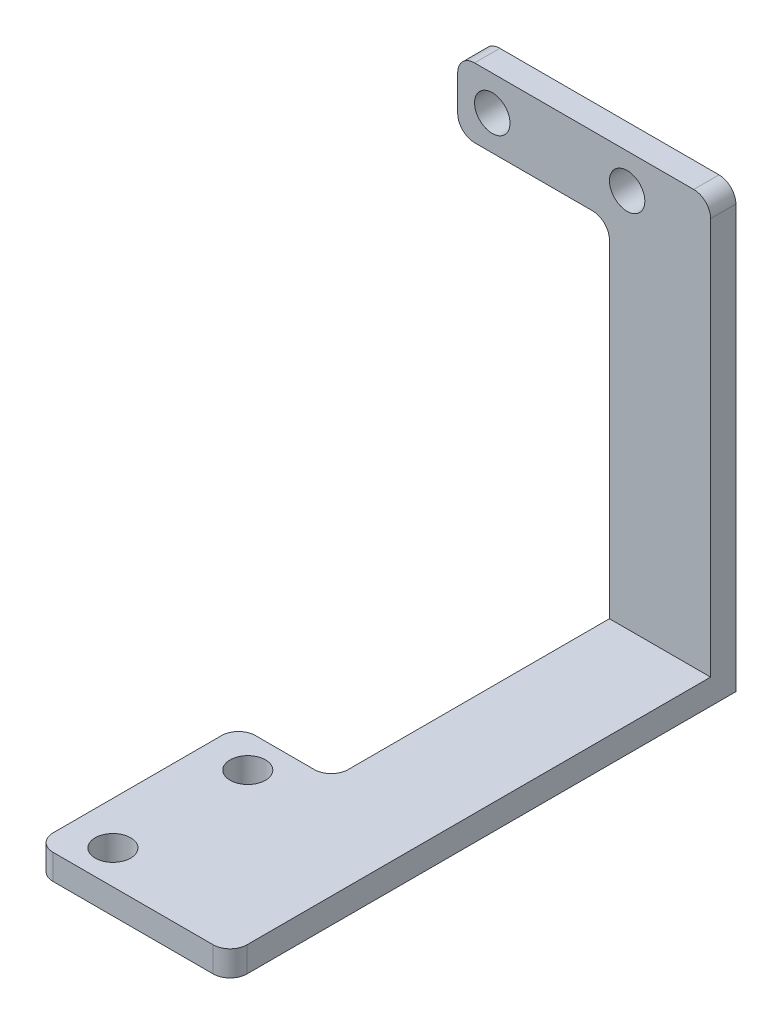
ISO-10303-21;
HEADER;
FILE_DESCRIPTION(('STEP AP214'),'2;1');
FILE_NAME('part.step','',(''),(''),'','','');
FILE_SCHEMA(('AUTOMOTIVE_DESIGN { 1 0 10303 214 1 1 1 1 }'));
ENDSEC;
DATA;
#1=APPLICATION_CONTEXT('core data for automotive mechanical design processes');
#2=APPLICATION_PROTOCOL_DEFINITION('international standard','automotive_design',2000,#1);
#3=PRODUCT_CONTEXT('',#1,'mechanical');
#4=PRODUCT('Part','Part','',(#3));
#5=PRODUCT_RELATED_PRODUCT_CATEGORY('part','',(#4));
#6=PRODUCT_DEFINITION_FORMATION('','',#4);
#7=PRODUCT_DEFINITION_CONTEXT('part definition',#1,'design');
#8=PRODUCT_DEFINITION('design','',#6,#7);
#9=PRODUCT_DEFINITION_SHAPE('','',#8);
#10=(LENGTH_UNIT() NAMED_UNIT(*) SI_UNIT(.MILLI.,.METRE.));
#11=(NAMED_UNIT(*) PLANE_ANGLE_UNIT() SI_UNIT($,.RADIAN.));
#12=(NAMED_UNIT(*) SI_UNIT($,.STERADIAN.) SOLID_ANGLE_UNIT());
#13=UNCERTAINTY_MEASURE_WITH_UNIT(LENGTH_MEASURE(1.E-05),#10,'distance_accuracy_value','');
#14=(GEOMETRIC_REPRESENTATION_CONTEXT(3) GLOBAL_UNCERTAINTY_ASSIGNED_CONTEXT((#13)) GLOBAL_UNIT_ASSIGNED_CONTEXT((#10,
#11,#12)) REPRESENTATION_CONTEXT('',''));
#15=CARTESIAN_POINT('',(0.,0.,0.));
#16=DIRECTION('',(0.,0.,1.));
#17=DIRECTION('',(1.,0.,0.));
#18=AXIS2_PLACEMENT_3D('',#15,#16,#17);
#19=CARTESIAN_POINT('',(0.,3.,0.));
#20=DIRECTION('',(0.,-1.,0.));
#21=DIRECTION('',(0.,0.,-1.));
#22=AXIS2_PLACEMENT_3D('',#19,#20,#21);
#23=PLANE('',#22);
#24=DIRECTION('',(1.,0.,0.));
#25=VECTOR('',#24,1.);
#26=CARTESIAN_POINT('',(6.00000000000001,3.,57.));
#27=LINE('',#26,#25);
#28=CARTESIAN_POINT('',(-15.,3.,57.));
#29=VERTEX_POINT('',#28);
#30=CARTESIAN_POINT('',(4.00000000000001,3.,57.));
#31=VERTEX_POINT('',#30);
#32=EDGE_CURVE('E224',#29,#31,#27,.T.);
#33=ORIENTED_EDGE('',*,*,#32,.T.);
#34=CARTESIAN_POINT('',(4.00000000000001,3.,55.));
#35=DIRECTION('',(0.,-1.,0.));
#36=DIRECTION('',(0.,0.,-1.));
#37=AXIS2_PLACEMENT_3D('',#34,#35,#36);
#38=CIRCLE('',#37,2.);
#39=CARTESIAN_POINT('',(6.00000000000001,3.,55.));
#40=VERTEX_POINT('',#39);
#41=EDGE_CURVE('E295',#31,#40,#38,.F.);
#42=ORIENTED_EDGE('',*,*,#41,.T.);
#43=DIRECTION('',(0.,0.,-1.));
#44=VECTOR('',#43,1.);
#45=CARTESIAN_POINT('',(6.,3.,0.));
#46=LINE('',#45,#44);
#47=CARTESIAN_POINT('',(6.,3.,0.));
#48=VERTEX_POINT('',#47);
#49=EDGE_CURVE('E227',#40,#48,#46,.T.);
#50=ORIENTED_EDGE('',*,*,#49,.T.);
#51=DIRECTION('',(-1.,0.,0.));
#52=VECTOR('',#51,1.);
#53=CARTESIAN_POINT('',(-6.,3.,0.));
#54=LINE('',#53,#52);
#55=CARTESIAN_POINT('',(-6.,3.,0.));
#56=VERTEX_POINT('',#55);
#57=EDGE_CURVE('E229',#48,#56,#54,.T.);
#58=ORIENTED_EDGE('',*,*,#57,.T.);
#59=DIRECTION('',(0.,0.,1.));
#60=VECTOR('',#59,1.);
#61=CARTESIAN_POINT('',(-6.,3.,0.));
#62=LINE('',#61,#60);
#63=CARTESIAN_POINT('',(-6.,3.,31.));
#64=VERTEX_POINT('',#63);
#65=EDGE_CURVE('E216',#56,#64,#62,.T.);
#66=ORIENTED_EDGE('',*,*,#65,.T.);
#67=CARTESIAN_POINT('',(-8.,3.,31.));
#68=DIRECTION('',(0.,-1.,0.));
#69=DIRECTION('',(0.,0.,-1.));
#70=AXIS2_PLACEMENT_3D('',#67,#68,#69);
#71=CIRCLE('',#70,2.);
#72=CARTESIAN_POINT('',(-8.,3.,33.));
#73=VERTEX_POINT('',#72);
#74=EDGE_CURVE('E302',#64,#73,#71,.T.);
#75=ORIENTED_EDGE('',*,*,#74,.T.);
#76=DIRECTION('',(-1.,0.,0.));
#77=VECTOR('',#76,1.);
#78=CARTESIAN_POINT('',(-6.,3.,33.));
#79=LINE('',#78,#77);
#80=CARTESIAN_POINT('',(-15.,3.,33.));
#81=VERTEX_POINT('',#80);
#82=EDGE_CURVE('E219',#73,#81,#79,.T.);
#83=ORIENTED_EDGE('',*,*,#82,.T.);
#84=CARTESIAN_POINT('',(-15.,3.,35.));
#85=DIRECTION('',(0.,-1.,0.));
#86=DIRECTION('',(0.,0.,-1.));
#87=AXIS2_PLACEMENT_3D('',#84,#85,#86);
#88=CIRCLE('',#87,2.);
#89=CARTESIAN_POINT('',(-17.,3.,35.));
#90=VERTEX_POINT('',#89);
#91=EDGE_CURVE('E54',#81,#90,#88,.F.);
#92=ORIENTED_EDGE('',*,*,#91,.T.);
#93=DIRECTION('',(0.,0.,1.));
#94=VECTOR('',#93,1.);
#95=CARTESIAN_POINT('',(-17.,3.,57.));
#96=LINE('',#95,#94);
#97=CARTESIAN_POINT('',(-17.,3.,55.));
#98=VERTEX_POINT('',#97);
#99=EDGE_CURVE('E222',#90,#98,#96,.T.);
#100=ORIENTED_EDGE('',*,*,#99,.T.);
#101=CARTESIAN_POINT('',(-15.,3.,55.));
#102=DIRECTION('',(0.,-1.,0.));
#103=DIRECTION('',(0.,0.,-1.));
#104=AXIS2_PLACEMENT_3D('',#101,#102,#103);
#105=CIRCLE('',#104,2.);
#106=EDGE_CURVE('E292',#98,#29,#105,.F.);
#107=ORIENTED_EDGE('',*,*,#106,.T.);
#108=EDGE_LOOP('',(#33,#42,#50,#58,#66,#75,#83,#92,#100,#107));
#109=FACE_BOUND('',#108,.T.);
#110=CARTESIAN_POINT('',(-11.9,3.,37.));
#111=DIRECTION('',(0.,1.,0.));
#112=DIRECTION('',(0.,0.,1.));
#113=AXIS2_PLACEMENT_3D('',#110,#111,#112);
#114=CIRCLE('',#113,2.09999999999999);
#115=CARTESIAN_POINT('',(-11.9,3.,39.1));
#116=VERTEX_POINT('',#115);
#117=EDGE_CURVE('E180',#116,#116,#114,.T.);
#118=ORIENTED_EDGE('',*,*,#117,.F.);
#119=EDGE_LOOP('',(#118));
#120=FACE_BOUND('',#119,.T.);
#121=CARTESIAN_POINT('',(-11.9,3.,53.));
#122=DIRECTION('',(0.,1.,0.));
#123=DIRECTION('',(0.,0.,1.));
#124=AXIS2_PLACEMENT_3D('',#121,#122,#123);
#125=CIRCLE('',#124,2.1);
#126=CARTESIAN_POINT('',(-11.9,3.,55.1));
#127=VERTEX_POINT('',#126);
#128=EDGE_CURVE('E190',#127,#127,#125,.T.);
#129=ORIENTED_EDGE('',*,*,#128,.F.);
#130=EDGE_LOOP('',(#129));
#131=FACE_BOUND('',#130,.T.);
#132=ADVANCED_FACE('F32',(#109,#120,#131),#23,.F.);
#133=CARTESIAN_POINT('',(0.,0.,0.));
#134=DIRECTION('',(0.,-1.,0.));
#135=DIRECTION('',(0.,0.,-1.));
#136=AXIS2_PLACEMENT_3D('',#133,#134,#135);
#137=PLANE('',#136);
#138=CARTESIAN_POINT('',(-11.9,0.,37.));
#139=DIRECTION('',(0.,1.,0.));
#140=DIRECTION('',(0.,0.,1.));
#141=AXIS2_PLACEMENT_3D('',#138,#139,#140);
#142=CIRCLE('',#141,2.09999999999999);
#143=CARTESIAN_POINT('',(-11.9,0.,39.1));
#144=VERTEX_POINT('',#143);
#145=EDGE_CURVE('E210',#144,#144,#142,.T.);
#146=ORIENTED_EDGE('',*,*,#145,.T.);
#147=EDGE_LOOP('',(#146));
#148=FACE_BOUND('',#147,.T.);
#149=DIRECTION('',(0.,0.,-1.));
#150=VECTOR('',#149,1.);
#151=CARTESIAN_POINT('',(6.,0.,0.));
#152=LINE('',#151,#150);
#153=CARTESIAN_POINT('',(6.00000000000001,0.,55.));
#154=VERTEX_POINT('',#153);
#155=CARTESIAN_POINT('',(6.,0.,-3.));
#156=VERTEX_POINT('',#155);
#157=EDGE_CURVE('E220',#154,#156,#152,.T.);
#158=ORIENTED_EDGE('',*,*,#157,.F.);
#159=CARTESIAN_POINT('',(4.00000000000001,0.,55.));
#160=DIRECTION('',(0.,-1.,0.));
#161=DIRECTION('',(0.,0.,-1.));
#162=AXIS2_PLACEMENT_3D('',#159,#160,#161);
#163=CIRCLE('',#162,2.);
#164=CARTESIAN_POINT('',(4.00000000000001,0.,57.));
#165=VERTEX_POINT('',#164);
#166=EDGE_CURVE('E285',#154,#165,#163,.T.);
#167=ORIENTED_EDGE('',*,*,#166,.T.);
#168=DIRECTION('',(1.,0.,0.));
#169=VECTOR('',#168,1.);
#170=CARTESIAN_POINT('',(6.00000000000001,0.,57.));
#171=LINE('',#170,#169);
#172=CARTESIAN_POINT('',(-15.,0.,57.));
#173=VERTEX_POINT('',#172);
#174=EDGE_CURVE('E237',#173,#165,#171,.T.);
#175=ORIENTED_EDGE('',*,*,#174,.F.);
#176=CARTESIAN_POINT('',(-15.,0.,55.));
#177=DIRECTION('',(0.,-1.,0.));
#178=DIRECTION('',(0.,0.,-1.));
#179=AXIS2_PLACEMENT_3D('',#176,#177,#178);
#180=CIRCLE('',#179,2.);
#181=CARTESIAN_POINT('',(-17.,0.,55.));
#182=VERTEX_POINT('',#181);
#183=EDGE_CURVE('E281',#173,#182,#180,.T.);
#184=ORIENTED_EDGE('',*,*,#183,.T.);
#185=DIRECTION('',(0.,0.,1.));
#186=VECTOR('',#185,1.);
#187=CARTESIAN_POINT('',(-17.,0.,57.));
#188=LINE('',#187,#186);
#189=CARTESIAN_POINT('',(-17.,0.,35.));
#190=VERTEX_POINT('',#189);
#191=EDGE_CURVE('E235',#190,#182,#188,.T.);
#192=ORIENTED_EDGE('',*,*,#191,.F.);
#193=CARTESIAN_POINT('',(-15.,0.,35.));
#194=DIRECTION('',(0.,-1.,0.));
#195=DIRECTION('',(0.,0.,-1.));
#196=AXIS2_PLACEMENT_3D('',#193,#194,#195);
#197=CIRCLE('',#196,2.);
#198=CARTESIAN_POINT('',(-15.,0.,33.));
#199=VERTEX_POINT('',#198);
#200=EDGE_CURVE('E283',#190,#199,#197,.T.);
#201=ORIENTED_EDGE('',*,*,#200,.T.);
#202=DIRECTION('',(-1.,0.,0.));
#203=VECTOR('',#202,1.);
#204=CARTESIAN_POINT('',(-6.,0.,33.));
#205=LINE('',#204,#203);
#206=CARTESIAN_POINT('',(-8.,0.,33.));
#207=VERTEX_POINT('',#206);
#208=EDGE_CURVE('E179',#207,#199,#205,.T.);
#209=ORIENTED_EDGE('',*,*,#208,.F.);
#210=CARTESIAN_POINT('',(-8.,0.,31.));
#211=DIRECTION('',(0.,-1.,0.));
#212=DIRECTION('',(0.,0.,-1.));
#213=AXIS2_PLACEMENT_3D('',#210,#211,#212);
#214=CIRCLE('',#213,2.);
#215=CARTESIAN_POINT('',(-6.,0.,31.));
#216=VERTEX_POINT('',#215);
#217=EDGE_CURVE('E178',#207,#216,#214,.F.);
#218=ORIENTED_EDGE('',*,*,#217,.T.);
#219=DIRECTION('',(0.,0.,1.));
#220=VECTOR('',#219,1.);
#221=CARTESIAN_POINT('',(-6.,0.,0.));
#222=LINE('',#221,#220);
#223=CARTESIAN_POINT('',(-6.,0.,-3.));
#224=VERTEX_POINT('',#223);
#225=EDGE_CURVE('E161',#224,#216,#222,.T.);
#226=ORIENTED_EDGE('',*,*,#225,.F.);
#227=DIRECTION('',(1.,0.,0.));
#228=VECTOR('',#227,1.);
#229=CARTESIAN_POINT('',(6.,0.,-3.));
#230=LINE('',#229,#228);
#231=EDGE_CURVE('E169',#224,#156,#230,.T.);
#232=ORIENTED_EDGE('',*,*,#231,.T.);
#233=EDGE_LOOP('',(#158,#167,#175,#184,#192,#201,#209,#218,#226,#232));
#234=FACE_BOUND('',#233,.T.);
#235=CARTESIAN_POINT('',(-11.9,0.,53.));
#236=DIRECTION('',(0.,1.,0.));
#237=DIRECTION('',(0.,0.,1.));
#238=AXIS2_PLACEMENT_3D('',#235,#236,#237);
#239=CIRCLE('',#238,2.1);
#240=CARTESIAN_POINT('',(-11.9,0.,55.1));
#241=VERTEX_POINT('',#240);
#242=EDGE_CURVE('E187',#241,#241,#239,.T.);
#243=ORIENTED_EDGE('',*,*,#242,.T.);
#244=EDGE_LOOP('',(#243));
#245=FACE_BOUND('',#244,.T.);
#246=ADVANCED_FACE('F175',(#148,#234,#245),#137,.T.);
#247=CARTESIAN_POINT('',(-6.,3.,0.));
#248=DIRECTION('',(1.,0.,0.));
#249=DIRECTION('',(0.,0.,-1.));
#250=AXIS2_PLACEMENT_3D('',#247,#248,#249);
#251=PLANE('',#250);
#252=ORIENTED_EDGE('',*,*,#225,.T.);
#253=DIRECTION('',(0.,-1.,0.));
#254=VECTOR('',#253,1.);
#255=CARTESIAN_POINT('',(-6.,3.,31.));
#256=LINE('',#255,#254);
#257=EDGE_CURVE('E246',#216,#64,#256,.F.);
#258=ORIENTED_EDGE('',*,*,#257,.T.);
#259=ORIENTED_EDGE('',*,*,#65,.F.);
#260=DIRECTION('',(0.,-1.,0.));
#261=VECTOR('',#260,1.);
#262=CARTESIAN_POINT('',(-6.,0.,0.));
#263=LINE('',#262,#261);
#264=CARTESIAN_POINT('',(-6.,41.9,0.));
#265=VERTEX_POINT('',#264);
#266=EDGE_CURVE('E207',#265,#56,#263,.T.);
#267=ORIENTED_EDGE('',*,*,#266,.F.);
#268=DIRECTION('',(0.,0.,1.));
#269=VECTOR('',#268,1.);
#270=CARTESIAN_POINT('',(-6.,41.9,0.));
#271=LINE('',#270,#269);
#272=CARTESIAN_POINT('',(-6.,41.9,-3.));
#273=VERTEX_POINT('',#272);
#274=EDGE_CURVE('E165',#265,#273,#271,.F.);
#275=ORIENTED_EDGE('',*,*,#274,.T.);
#276=DIRECTION('',(0.,-1.,0.));
#277=VECTOR('',#276,1.);
#278=CARTESIAN_POINT('',(-6.,0.,-3.));
#279=LINE('',#278,#277);
#280=EDGE_CURVE('E158',#273,#224,#279,.T.);
#281=ORIENTED_EDGE('',*,*,#280,.T.);
#282=EDGE_LOOP('',(#252,#258,#259,#267,#275,#281));
#283=FACE_BOUND('',#282,.T.);
#284=ADVANCED_FACE('F160',(#283),#251,.F.);
#285=CARTESIAN_POINT('',(-6.,3.,33.));
#286=DIRECTION('',(0.,0.,1.));
#287=DIRECTION('',(1.,0.,0.));
#288=AXIS2_PLACEMENT_3D('',#285,#286,#287);
#289=PLANE('',#288);
#290=ORIENTED_EDGE('',*,*,#82,.F.);
#291=DIRECTION('',(0.,-1.,0.));
#292=VECTOR('',#291,1.);
#293=CARTESIAN_POINT('',(-8.,0.,33.));
#294=LINE('',#293,#292);
#295=EDGE_CURVE('E242',#73,#207,#294,.T.);
#296=ORIENTED_EDGE('',*,*,#295,.T.);
#297=ORIENTED_EDGE('',*,*,#208,.T.);
#298=DIRECTION('',(0.,-1.,0.));
#299=VECTOR('',#298,1.);
#300=CARTESIAN_POINT('',(-15.,3.,33.));
#301=LINE('',#300,#299);
#302=EDGE_CURVE('E231',#199,#81,#301,.F.);
#303=ORIENTED_EDGE('',*,*,#302,.T.);
#304=EDGE_LOOP('',(#290,#296,#297,#303));
#305=FACE_BOUND('',#304,.T.);
#306=ADVANCED_FACE('F383',(#305),#289,.F.);
#307=CARTESIAN_POINT('',(-17.,3.,57.));
#308=DIRECTION('',(1.,0.,0.));
#309=DIRECTION('',(0.,0.,-1.));
#310=AXIS2_PLACEMENT_3D('',#307,#308,#309);
#311=PLANE('',#310);
#312=ORIENTED_EDGE('',*,*,#99,.F.);
#313=DIRECTION('',(0.,-1.,0.));
#314=VECTOR('',#313,1.);
#315=CARTESIAN_POINT('',(-17.,3.,35.));
#316=LINE('',#315,#314);
#317=EDGE_CURVE('E298',#90,#190,#316,.T.);
#318=ORIENTED_EDGE('',*,*,#317,.T.);
#319=ORIENTED_EDGE('',*,*,#191,.T.);
#320=DIRECTION('',(0.,-1.,0.));
#321=VECTOR('',#320,1.);
#322=CARTESIAN_POINT('',(-17.,3.,55.));
#323=LINE('',#322,#321);
#324=EDGE_CURVE('E47',#182,#98,#323,.F.);
#325=ORIENTED_EDGE('',*,*,#324,.T.);
#326=EDGE_LOOP('',(#312,#318,#319,#325));
#327=FACE_BOUND('',#326,.T.);
#328=ADVANCED_FACE('F379',(#327),#311,.F.);
#329=CARTESIAN_POINT('',(6.00000000000001,3.,57.));
#330=DIRECTION('',(0.,0.,-1.));
#331=DIRECTION('',(-1.,0.,0.));
#332=AXIS2_PLACEMENT_3D('',#329,#330,#331);
#333=PLANE('',#332);
#334=ORIENTED_EDGE('',*,*,#174,.T.);
#335=DIRECTION('',(0.,-1.,0.));
#336=VECTOR('',#335,1.);
#337=CARTESIAN_POINT('',(4.00000000000001,3.,57.));
#338=LINE('',#337,#336);
#339=EDGE_CURVE('E290',#165,#31,#338,.F.);
#340=ORIENTED_EDGE('',*,*,#339,.T.);
#341=ORIENTED_EDGE('',*,*,#32,.F.);
#342=DIRECTION('',(0.,-1.,0.));
#343=VECTOR('',#342,1.);
#344=CARTESIAN_POINT('',(-15.,3.,57.));
#345=LINE('',#344,#343);
#346=EDGE_CURVE('E287',#29,#173,#345,.T.);
#347=ORIENTED_EDGE('',*,*,#346,.T.);
#348=EDGE_LOOP('',(#334,#340,#341,#347));
#349=FACE_BOUND('',#348,.T.);
#350=ADVANCED_FACE('F375',(#349),#333,.F.);
#351=CARTESIAN_POINT('',(6.,3.,0.));
#352=DIRECTION('',(-1.,0.,0.));
#353=DIRECTION('',(0.,0.,1.));
#354=AXIS2_PLACEMENT_3D('',#351,#352,#353);
#355=PLANE('',#354);
#356=DIRECTION('',(0.,1.,0.));
#357=VECTOR('',#356,1.);
#358=CARTESIAN_POINT('',(6.,0.,-3.));
#359=LINE('',#358,#357);
#360=CARTESIAN_POINT('',(6.,50.1,-3.));
#361=VERTEX_POINT('',#360);
#362=EDGE_CURVE('E186',#156,#361,#359,.T.);
#363=ORIENTED_EDGE('',*,*,#362,.T.);
#364=DIRECTION('',(0.,0.,1.));
#365=VECTOR('',#364,1.);
#366=CARTESIAN_POINT('',(6.,50.1,0.));
#367=LINE('',#366,#365);
#368=CARTESIAN_POINT('',(6.,50.1,0.));
#369=VERTEX_POINT('',#368);
#370=EDGE_CURVE('E251',#361,#369,#367,.T.);
#371=ORIENTED_EDGE('',*,*,#370,.T.);
#372=DIRECTION('',(0.,1.,0.));
#373=VECTOR('',#372,1.);
#374=CARTESIAN_POINT('',(6.,0.,0.));
#375=LINE('',#374,#373);
#376=EDGE_CURVE('E194',#48,#369,#375,.T.);
#377=ORIENTED_EDGE('',*,*,#376,.F.);
#378=ORIENTED_EDGE('',*,*,#49,.F.);
#379=DIRECTION('',(0.,-1.,0.));
#380=VECTOR('',#379,1.);
#381=CARTESIAN_POINT('',(6.00000000000001,3.,55.));
#382=LINE('',#381,#380);
#383=EDGE_CURVE('E248',#40,#154,#382,.T.);
#384=ORIENTED_EDGE('',*,*,#383,.T.);
#385=ORIENTED_EDGE('',*,*,#157,.T.);
#386=EDGE_LOOP('',(#363,#371,#377,#378,#384,#385));
#387=FACE_BOUND('',#386,.T.);
#388=ADVANCED_FACE('F372',(#387),#355,.F.);
#389=CARTESIAN_POINT('',(-11.9,3.,37.));
#390=DIRECTION('',(0.,-1.,0.));
#391=DIRECTION('',(0.,0.,-1.));
#392=AXIS2_PLACEMENT_3D('',#389,#390,#391);
#393=CYLINDRICAL_SURFACE('',#392,2.09999999999999);
#394=ORIENTED_EDGE('',*,*,#117,.T.);
#395=EDGE_LOOP('',(#394));
#396=FACE_BOUND('',#395,.T.);
#397=ORIENTED_EDGE('',*,*,#145,.F.);
#398=EDGE_LOOP('',(#397));
#399=FACE_BOUND('',#398,.T.);
#400=ADVANCED_FACE('F357',(#396,#399),#393,.F.);
#401=CARTESIAN_POINT('',(-11.9,3.,53.));
#402=DIRECTION('',(0.,-1.,0.));
#403=DIRECTION('',(0.,0.,-1.));
#404=AXIS2_PLACEMENT_3D('',#401,#402,#403);
#405=CYLINDRICAL_SURFACE('',#404,2.1);
#406=ORIENTED_EDGE('',*,*,#128,.T.);
#407=EDGE_LOOP('',(#406));
#408=FACE_BOUND('',#407,.T.);
#409=ORIENTED_EDGE('',*,*,#242,.F.);
#410=EDGE_LOOP('',(#409));
#411=FACE_BOUND('',#410,.T.);
#412=ADVANCED_FACE('F348',(#408,#411),#405,.F.);
#413=CARTESIAN_POINT('',(0.,0.,0.));
#414=DIRECTION('',(0.,0.,1.));
#415=DIRECTION('',(1.,0.,0.));
#416=AXIS2_PLACEMENT_3D('',#413,#414,#415);
#417=PLANE('',#416);
#418=CARTESIAN_POINT('',(-19.9,48.,0.));
#419=DIRECTION('',(0.,0.,1.));
#420=DIRECTION('',(1.,0.,0.));
#421=AXIS2_PLACEMENT_3D('',#418,#419,#420);
#422=CIRCLE('',#421,2.1);
#423=CARTESIAN_POINT('',(-17.8,48.,0.));
#424=VERTEX_POINT('',#423);
#425=EDGE_CURVE('E325',#424,#424,#422,.T.);
#426=ORIENTED_EDGE('',*,*,#425,.F.);
#427=EDGE_LOOP('',(#426));
#428=FACE_BOUND('',#427,.T.);
#429=CARTESIAN_POINT('',(-3.89999999999999,48.,0.));
#430=DIRECTION('',(0.,0.,1.));
#431=DIRECTION('',(1.,0.,0.));
#432=AXIS2_PLACEMENT_3D('',#429,#430,#431);
#433=CIRCLE('',#432,2.1);
#434=CARTESIAN_POINT('',(-1.8,48.,0.));
#435=VERTEX_POINT('',#434);
#436=EDGE_CURVE('E331',#435,#435,#433,.T.);
#437=ORIENTED_EDGE('',*,*,#436,.F.);
#438=EDGE_LOOP('',(#437));
#439=FACE_BOUND('',#438,.T.);
#440=ORIENTED_EDGE('',*,*,#376,.T.);
#441=CARTESIAN_POINT('',(4.,50.1,0.));
#442=DIRECTION('',(0.,0.,1.));
#443=DIRECTION('',(1.,0.,0.));
#444=AXIS2_PLACEMENT_3D('',#441,#442,#443);
#445=CIRCLE('',#444,2.);
#446=CARTESIAN_POINT('',(4.,52.1,0.));
#447=VERTEX_POINT('',#446);
#448=EDGE_CURVE('E258',#369,#447,#445,.T.);
#449=ORIENTED_EDGE('',*,*,#448,.T.);
#450=DIRECTION('',(-1.,0.,0.));
#451=VECTOR('',#450,1.);
#452=CARTESIAN_POINT('',(6.,52.1,0.));
#453=LINE('',#452,#451);
#454=CARTESIAN_POINT('',(-22.,52.1,0.));
#455=VERTEX_POINT('',#454);
#456=EDGE_CURVE('E197',#447,#455,#453,.T.);
#457=ORIENTED_EDGE('',*,*,#456,.T.);
#458=CARTESIAN_POINT('',(-22.,50.1,0.));
#459=DIRECTION('',(0.,0.,1.));
#460=DIRECTION('',(1.,0.,0.));
#461=AXIS2_PLACEMENT_3D('',#458,#459,#460);
#462=CIRCLE('',#461,2.);
#463=CARTESIAN_POINT('',(-24.,50.1,0.));
#464=VERTEX_POINT('',#463);
#465=EDGE_CURVE('E256',#455,#464,#462,.T.);
#466=ORIENTED_EDGE('',*,*,#465,.T.);
#467=DIRECTION('',(0.,-1.,0.));
#468=VECTOR('',#467,1.);
#469=CARTESIAN_POINT('',(-24.,52.1,0.));
#470=LINE('',#469,#468);
#471=CARTESIAN_POINT('',(-24.,45.9,0.));
#472=VERTEX_POINT('',#471);
#473=EDGE_CURVE('E201',#464,#472,#470,.T.);
#474=ORIENTED_EDGE('',*,*,#473,.T.);
#475=CARTESIAN_POINT('',(-22.,45.9,0.));
#476=DIRECTION('',(0.,0.,1.));
#477=DIRECTION('',(1.,0.,0.));
#478=AXIS2_PLACEMENT_3D('',#475,#476,#477);
#479=CIRCLE('',#478,2.);
#480=CARTESIAN_POINT('',(-22.,43.9,0.));
#481=VERTEX_POINT('',#480);
#482=EDGE_CURVE('E254',#472,#481,#479,.T.);
#483=ORIENTED_EDGE('',*,*,#482,.T.);
#484=DIRECTION('',(1.,0.,0.));
#485=VECTOR('',#484,1.);
#486=CARTESIAN_POINT('',(-6.,43.9,0.));
#487=LINE('',#486,#485);
#488=CARTESIAN_POINT('',(-8.,43.9,0.));
#489=VERTEX_POINT('',#488);
#490=EDGE_CURVE('E204',#481,#489,#487,.T.);
#491=ORIENTED_EDGE('',*,*,#490,.T.);
#492=CARTESIAN_POINT('',(-8.,41.9,0.));
#493=DIRECTION('',(0.,0.,1.));
#494=DIRECTION('',(1.,0.,0.));
#495=AXIS2_PLACEMENT_3D('',#492,#493,#494);
#496=CIRCLE('',#495,2.);
#497=EDGE_CURVE('E40',#489,#265,#496,.F.);
#498=ORIENTED_EDGE('',*,*,#497,.T.);
#499=ORIENTED_EDGE('',*,*,#266,.T.);
#500=ORIENTED_EDGE('',*,*,#57,.F.);
#501=EDGE_LOOP('',(#440,#449,#457,#466,#474,#483,#491,#498,#499,#500));
#502=FACE_BOUND('',#501,.T.);
#503=ADVANCED_FACE('F304',(#428,#439,#502),#417,.T.);
#504=CARTESIAN_POINT('',(-6.,43.9,-3.));
#505=DIRECTION('',(0.,-1.,0.));
#506=DIRECTION('',(0.,0.,-1.));
#507=AXIS2_PLACEMENT_3D('',#504,#505,#506);
#508=PLANE('',#507);
#509=ORIENTED_EDGE('',*,*,#490,.F.);
#510=DIRECTION('',(0.,0.,1.));
#511=VECTOR('',#510,1.);
#512=CARTESIAN_POINT('',(-22.,43.9,-3.));
#513=LINE('',#512,#511);
#514=CARTESIAN_POINT('',(-22.,43.9,-3.));
#515=VERTEX_POINT('',#514);
#516=EDGE_CURVE('E279',#481,#515,#513,.F.);
#517=ORIENTED_EDGE('',*,*,#516,.T.);
#518=DIRECTION('',(1.,0.,0.));
#519=VECTOR('',#518,1.);
#520=CARTESIAN_POINT('',(-6.,43.9,-3.));
#521=LINE('',#520,#519);
#522=CARTESIAN_POINT('',(-8.,43.9,-3.));
#523=VERTEX_POINT('',#522);
#524=EDGE_CURVE('E170',#515,#523,#521,.T.);
#525=ORIENTED_EDGE('',*,*,#524,.T.);
#526=DIRECTION('',(0.,0.,1.));
#527=VECTOR('',#526,1.);
#528=CARTESIAN_POINT('',(-8.,43.9,-3.));
#529=LINE('',#528,#527);
#530=EDGE_CURVE('E276',#523,#489,#529,.T.);
#531=ORIENTED_EDGE('',*,*,#530,.T.);
#532=EDGE_LOOP('',(#509,#517,#525,#531));
#533=FACE_BOUND('',#532,.T.);
#534=ADVANCED_FACE('F315',(#533),#508,.T.);
#535=CARTESIAN_POINT('',(-24.,52.1,-3.));
#536=DIRECTION('',(-1.,0.,0.));
#537=DIRECTION('',(0.,0.,1.));
#538=AXIS2_PLACEMENT_3D('',#535,#536,#537);
#539=PLANE('',#538);
#540=ORIENTED_EDGE('',*,*,#473,.F.);
#541=DIRECTION('',(0.,0.,1.));
#542=VECTOR('',#541,1.);
#543=CARTESIAN_POINT('',(-24.,50.1,-3.));
#544=LINE('',#543,#542);
#545=CARTESIAN_POINT('',(-24.,50.1,-3.));
#546=VERTEX_POINT('',#545);
#547=EDGE_CURVE('E274',#464,#546,#544,.F.);
#548=ORIENTED_EDGE('',*,*,#547,.T.);
#549=DIRECTION('',(0.,-1.,0.));
#550=VECTOR('',#549,1.);
#551=CARTESIAN_POINT('',(-24.,52.1,-3.));
#552=LINE('',#551,#550);
#553=CARTESIAN_POINT('',(-24.,45.9,-3.));
#554=VERTEX_POINT('',#553);
#555=EDGE_CURVE('E317',#546,#554,#552,.T.);
#556=ORIENTED_EDGE('',*,*,#555,.T.);
#557=DIRECTION('',(0.,0.,1.));
#558=VECTOR('',#557,1.);
#559=CARTESIAN_POINT('',(-24.,45.9,-3.));
#560=LINE('',#559,#558);
#561=EDGE_CURVE('E271',#554,#472,#560,.T.);
#562=ORIENTED_EDGE('',*,*,#561,.T.);
#563=EDGE_LOOP('',(#540,#548,#556,#562));
#564=FACE_BOUND('',#563,.T.);
#565=ADVANCED_FACE('F355',(#564),#539,.T.);
#566=CARTESIAN_POINT('',(6.,52.1,-3.));
#567=DIRECTION('',(0.,1.,0.));
#568=DIRECTION('',(0.,0.,1.));
#569=AXIS2_PLACEMENT_3D('',#566,#567,#568);
#570=PLANE('',#569);
#571=ORIENTED_EDGE('',*,*,#456,.F.);
#572=DIRECTION('',(0.,0.,1.));
#573=VECTOR('',#572,1.);
#574=CARTESIAN_POINT('',(4.,52.1,-3.));
#575=LINE('',#574,#573);
#576=CARTESIAN_POINT('',(4.,52.1,-3.));
#577=VERTEX_POINT('',#576);
#578=EDGE_CURVE('E263',#447,#577,#575,.F.);
#579=ORIENTED_EDGE('',*,*,#578,.T.);
#580=DIRECTION('',(-1.,0.,0.));
#581=VECTOR('',#580,1.);
#582=CARTESIAN_POINT('',(6.,52.1,-3.));
#583=LINE('',#582,#581);
#584=CARTESIAN_POINT('',(-22.,52.1,-3.));
#585=VERTEX_POINT('',#584);
#586=EDGE_CURVE('E319',#577,#585,#583,.T.);
#587=ORIENTED_EDGE('',*,*,#586,.T.);
#588=DIRECTION('',(0.,0.,1.));
#589=VECTOR('',#588,1.);
#590=CARTESIAN_POINT('',(-22.,52.1,-3.));
#591=LINE('',#590,#589);
#592=EDGE_CURVE('E260',#585,#455,#591,.T.);
#593=ORIENTED_EDGE('',*,*,#592,.T.);
#594=EDGE_LOOP('',(#571,#579,#587,#593));
#595=FACE_BOUND('',#594,.T.);
#596=ADVANCED_FACE('F432',(#595),#570,.T.);
#597=CARTESIAN_POINT('',(0.,0.,-3.));
#598=DIRECTION('',(0.,0.,1.));
#599=DIRECTION('',(1.,0.,0.));
#600=AXIS2_PLACEMENT_3D('',#597,#598,#599);
#601=PLANE('',#600);
#602=CARTESIAN_POINT('',(-3.89999999999999,48.,-3.));
#603=DIRECTION('',(0.,0.,1.));
#604=DIRECTION('',(1.,0.,0.));
#605=AXIS2_PLACEMENT_3D('',#602,#603,#604);
#606=CIRCLE('',#605,2.1);
#607=CARTESIAN_POINT('',(-1.8,48.,-3.));
#608=VERTEX_POINT('',#607);
#609=EDGE_CURVE('E328',#608,#608,#606,.T.);
#610=ORIENTED_EDGE('',*,*,#609,.T.);
#611=EDGE_LOOP('',(#610));
#612=FACE_BOUND('',#611,.T.);
#613=CARTESIAN_POINT('',(-19.9,48.,-3.));
#614=DIRECTION('',(0.,0.,1.));
#615=DIRECTION('',(1.,0.,0.));
#616=AXIS2_PLACEMENT_3D('',#613,#614,#615);
#617=CIRCLE('',#616,2.1);
#618=CARTESIAN_POINT('',(-17.8,48.,-3.));
#619=VERTEX_POINT('',#618);
#620=EDGE_CURVE('E198',#619,#619,#617,.T.);
#621=ORIENTED_EDGE('',*,*,#620,.T.);
#622=EDGE_LOOP('',(#621));
#623=FACE_BOUND('',#622,.T.);
#624=ORIENTED_EDGE('',*,*,#586,.F.);
#625=CARTESIAN_POINT('',(4.,50.1,-3.));
#626=DIRECTION('',(0.,0.,1.));
#627=DIRECTION('',(1.,0.,0.));
#628=AXIS2_PLACEMENT_3D('',#625,#626,#627);
#629=CIRCLE('',#628,2.);
#630=EDGE_CURVE('E269',#577,#361,#629,.F.);
#631=ORIENTED_EDGE('',*,*,#630,.T.);
#632=ORIENTED_EDGE('',*,*,#362,.F.);
#633=ORIENTED_EDGE('',*,*,#231,.F.);
#634=ORIENTED_EDGE('',*,*,#280,.F.);
#635=CARTESIAN_POINT('',(-8.,41.9,-3.));
#636=DIRECTION('',(0.,0.,1.));
#637=DIRECTION('',(1.,0.,0.));
#638=AXIS2_PLACEMENT_3D('',#635,#636,#637);
#639=CIRCLE('',#638,2.);
#640=EDGE_CURVE('E11',#273,#523,#639,.T.);
#641=ORIENTED_EDGE('',*,*,#640,.T.);
#642=ORIENTED_EDGE('',*,*,#524,.F.);
#643=CARTESIAN_POINT('',(-22.,45.9,-3.));
#644=DIRECTION('',(0.,0.,1.));
#645=DIRECTION('',(1.,0.,0.));
#646=AXIS2_PLACEMENT_3D('',#643,#644,#645);
#647=CIRCLE('',#646,2.);
#648=EDGE_CURVE('E265',#515,#554,#647,.F.);
#649=ORIENTED_EDGE('',*,*,#648,.T.);
#650=ORIENTED_EDGE('',*,*,#555,.F.);
#651=CARTESIAN_POINT('',(-22.,50.1,-3.));
#652=DIRECTION('',(0.,0.,1.));
#653=DIRECTION('',(1.,0.,0.));
#654=AXIS2_PLACEMENT_3D('',#651,#652,#653);
#655=CIRCLE('',#654,2.);
#656=EDGE_CURVE('E267',#546,#585,#655,.F.);
#657=ORIENTED_EDGE('',*,*,#656,.T.);
#658=EDGE_LOOP('',(#624,#631,#632,#633,#634,#641,#642,#649,#650,#657));
#659=FACE_BOUND('',#658,.T.);
#660=ADVANCED_FACE('F184',(#612,#623,#659),#601,.F.);
#661=CARTESIAN_POINT('',(-19.9,48.,-3.));
#662=DIRECTION('',(0.,0.,1.));
#663=DIRECTION('',(1.,0.,0.));
#664=AXIS2_PLACEMENT_3D('',#661,#662,#663);
#665=CYLINDRICAL_SURFACE('',#664,2.1);
#666=ORIENTED_EDGE('',*,*,#620,.F.);
#667=EDGE_LOOP('',(#666));
#668=FACE_BOUND('',#667,.T.);
#669=ORIENTED_EDGE('',*,*,#425,.T.);
#670=EDGE_LOOP('',(#669));
#671=FACE_BOUND('',#670,.T.);
#672=ADVANCED_FACE('F343',(#668,#671),#665,.F.);
#673=CARTESIAN_POINT('',(-3.89999999999999,48.,-3.));
#674=DIRECTION('',(0.,0.,1.));
#675=DIRECTION('',(1.,0.,0.));
#676=AXIS2_PLACEMENT_3D('',#673,#674,#675);
#677=CYLINDRICAL_SURFACE('',#676,2.1);
#678=ORIENTED_EDGE('',*,*,#609,.F.);
#679=EDGE_LOOP('',(#678));
#680=FACE_BOUND('',#679,.T.);
#681=ORIENTED_EDGE('',*,*,#436,.T.);
#682=EDGE_LOOP('',(#681));
#683=FACE_BOUND('',#682,.T.);
#684=ADVANCED_FACE('F339',(#680,#683),#677,.F.);
#685=CARTESIAN_POINT('',(-8.,3.,31.));
#686=DIRECTION('',(0.,1.,0.));
#687=DIRECTION('',(0.,0.,1.));
#688=AXIS2_PLACEMENT_3D('',#685,#686,#687);
#689=CYLINDRICAL_SURFACE('',#688,2.);
#690=ORIENTED_EDGE('',*,*,#74,.F.);
#691=ORIENTED_EDGE('',*,*,#257,.F.);
#692=ORIENTED_EDGE('',*,*,#217,.F.);
#693=ORIENTED_EDGE('',*,*,#295,.F.);
#694=EDGE_LOOP('',(#690,#691,#692,#693));
#695=FACE_BOUND('',#694,.T.);
#696=ADVANCED_FACE('F342',(#695),#689,.F.);
#697=CARTESIAN_POINT('',(4.,50.1,0.));
#698=DIRECTION('',(0.,0.,-1.));
#699=DIRECTION('',(-1.,0.,0.));
#700=AXIS2_PLACEMENT_3D('',#697,#698,#699);
#701=CYLINDRICAL_SURFACE('',#700,2.);
#702=ORIENTED_EDGE('',*,*,#630,.F.);
#703=ORIENTED_EDGE('',*,*,#578,.F.);
#704=ORIENTED_EDGE('',*,*,#448,.F.);
#705=ORIENTED_EDGE('',*,*,#370,.F.);
#706=EDGE_LOOP('',(#702,#703,#704,#705));
#707=FACE_BOUND('',#706,.T.);
#708=ADVANCED_FACE('F391',(#707),#701,.T.);
#709=CARTESIAN_POINT('',(-22.,50.1,-3.));
#710=DIRECTION('',(0.,0.,1.));
#711=DIRECTION('',(1.,0.,0.));
#712=AXIS2_PLACEMENT_3D('',#709,#710,#711);
#713=CYLINDRICAL_SURFACE('',#712,2.);
#714=ORIENTED_EDGE('',*,*,#656,.F.);
#715=ORIENTED_EDGE('',*,*,#547,.F.);
#716=ORIENTED_EDGE('',*,*,#465,.F.);
#717=ORIENTED_EDGE('',*,*,#592,.F.);
#718=EDGE_LOOP('',(#714,#715,#716,#717));
#719=FACE_BOUND('',#718,.T.);
#720=ADVANCED_FACE('F395',(#719),#713,.T.);
#721=CARTESIAN_POINT('',(-22.,45.9,-3.));
#722=DIRECTION('',(0.,0.,1.));
#723=DIRECTION('',(1.,0.,0.));
#724=AXIS2_PLACEMENT_3D('',#721,#722,#723);
#725=CYLINDRICAL_SURFACE('',#724,2.);
#726=ORIENTED_EDGE('',*,*,#648,.F.);
#727=ORIENTED_EDGE('',*,*,#516,.F.);
#728=ORIENTED_EDGE('',*,*,#482,.F.);
#729=ORIENTED_EDGE('',*,*,#561,.F.);
#730=EDGE_LOOP('',(#726,#727,#728,#729));
#731=FACE_BOUND('',#730,.T.);
#732=ADVANCED_FACE('F399',(#731),#725,.T.);
#733=CARTESIAN_POINT('',(-8.,41.9,-3.));
#734=DIRECTION('',(0.,0.,1.));
#735=DIRECTION('',(1.,0.,0.));
#736=AXIS2_PLACEMENT_3D('',#733,#734,#735);
#737=CYLINDRICAL_SURFACE('',#736,2.);
#738=ORIENTED_EDGE('',*,*,#640,.F.);
#739=ORIENTED_EDGE('',*,*,#274,.F.);
#740=ORIENTED_EDGE('',*,*,#497,.F.);
#741=ORIENTED_EDGE('',*,*,#530,.F.);
#742=EDGE_LOOP('',(#738,#739,#740,#741));
#743=FACE_BOUND('',#742,.T.);
#744=ADVANCED_FACE('F310',(#743),#737,.F.);
#745=CARTESIAN_POINT('',(4.00000000000001,3.,55.));
#746=DIRECTION('',(0.,-1.,0.));
#747=DIRECTION('',(0.,0.,-1.));
#748=AXIS2_PLACEMENT_3D('',#745,#746,#747);
#749=CYLINDRICAL_SURFACE('',#748,2.);
#750=ORIENTED_EDGE('',*,*,#41,.F.);
#751=ORIENTED_EDGE('',*,*,#339,.F.);
#752=ORIENTED_EDGE('',*,*,#166,.F.);
#753=ORIENTED_EDGE('',*,*,#383,.F.);
#754=EDGE_LOOP('',(#750,#751,#752,#753));
#755=FACE_BOUND('',#754,.T.);
#756=ADVANCED_FACE('F406',(#755),#749,.T.);
#757=CARTESIAN_POINT('',(-15.,3.,35.));
#758=DIRECTION('',(0.,-1.,0.));
#759=DIRECTION('',(0.,0.,-1.));
#760=AXIS2_PLACEMENT_3D('',#757,#758,#759);
#761=CYLINDRICAL_SURFACE('',#760,2.);
#762=ORIENTED_EDGE('',*,*,#91,.F.);
#763=ORIENTED_EDGE('',*,*,#302,.F.);
#764=ORIENTED_EDGE('',*,*,#200,.F.);
#765=ORIENTED_EDGE('',*,*,#317,.F.);
#766=EDGE_LOOP('',(#762,#763,#764,#765));
#767=FACE_BOUND('',#766,.T.);
#768=ADVANCED_FACE('F408',(#767),#761,.T.);
#769=CARTESIAN_POINT('',(-15.,3.,55.));
#770=DIRECTION('',(0.,-1.,0.));
#771=DIRECTION('',(0.,0.,-1.));
#772=AXIS2_PLACEMENT_3D('',#769,#770,#771);
#773=CYLINDRICAL_SURFACE('',#772,2.);
#774=ORIENTED_EDGE('',*,*,#106,.F.);
#775=ORIENTED_EDGE('',*,*,#324,.F.);
#776=ORIENTED_EDGE('',*,*,#183,.F.);
#777=ORIENTED_EDGE('',*,*,#346,.F.);
#778=EDGE_LOOP('',(#774,#775,#776,#777));
#779=FACE_BOUND('',#778,.T.);
#780=ADVANCED_FACE('F34',(#779),#773,.T.);
#781=CLOSED_SHELL('',(#132,#246,#284,#306,#328,#350,#388,#400,#412,#503,#534,#565,#596,#660,
#672,#684,#696,#708,#720,#732,#744,#756,#768,#780));
#782=MANIFOLD_SOLID_BREP('B2',#781);
#783=ADVANCED_BREP_SHAPE_REPRESENTATION('',(#18,#782),#14);
#784=SHAPE_DEFINITION_REPRESENTATION(#9,#783);
ENDSEC;
END-ISO-10303-21;
